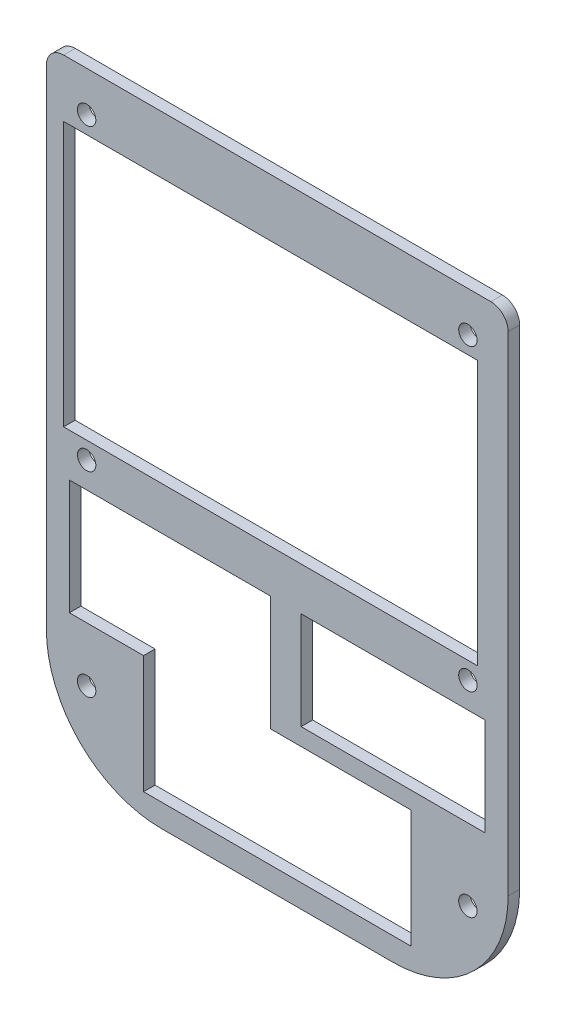
ISO-10303-21;
HEADER;
FILE_DESCRIPTION(('STEP AP214'),'2;1');
FILE_NAME('part.step','',(''),(''),'','','');
FILE_SCHEMA(('AUTOMOTIVE_DESIGN { 1 0 10303 214 1 1 1 1 }'));
ENDSEC;
DATA;
#1=APPLICATION_CONTEXT('core data for automotive mechanical design processes');
#2=APPLICATION_PROTOCOL_DEFINITION('international standard','automotive_design',2000,#1);
#3=PRODUCT_CONTEXT('',#1,'mechanical');
#4=PRODUCT('Part','Part','',(#3));
#5=PRODUCT_RELATED_PRODUCT_CATEGORY('part','',(#4));
#6=PRODUCT_DEFINITION_FORMATION('','',#4);
#7=PRODUCT_DEFINITION_CONTEXT('part definition',#1,'design');
#8=PRODUCT_DEFINITION('design','',#6,#7);
#9=PRODUCT_DEFINITION_SHAPE('','',#8);
#10=(LENGTH_UNIT() NAMED_UNIT(*) SI_UNIT(.MILLI.,.METRE.));
#11=(NAMED_UNIT(*) PLANE_ANGLE_UNIT() SI_UNIT($,.RADIAN.));
#12=(NAMED_UNIT(*) SI_UNIT($,.STERADIAN.) SOLID_ANGLE_UNIT());
#13=UNCERTAINTY_MEASURE_WITH_UNIT(LENGTH_MEASURE(1.E-05),#10,'distance_accuracy_value','');
#14=(GEOMETRIC_REPRESENTATION_CONTEXT(3) GLOBAL_UNCERTAINTY_ASSIGNED_CONTEXT((#13)) GLOBAL_UNIT_ASSIGNED_CONTEXT((#10,
#11,#12)) REPRESENTATION_CONTEXT('',''));
#15=CARTESIAN_POINT('',(0.,0.,0.));
#16=DIRECTION('',(0.,0.,1.));
#17=DIRECTION('',(1.,0.,0.));
#18=AXIS2_PLACEMENT_3D('',#15,#16,#17);
#19=CARTESIAN_POINT('',(0.,0.,2.));
#20=DIRECTION('',(0.,0.,-1.));
#21=DIRECTION('',(-1.,0.,0.));
#22=AXIS2_PLACEMENT_3D('',#19,#20,#21);
#23=PLANE('',#22);
#24=DIRECTION('',(0.,-1.,0.));
#25=VECTOR('',#24,1.);
#26=CARTESIAN_POINT('',(39.,0.,2.));
#27=LINE('',#26,#25);
#28=CARTESIAN_POINT('',(39.,2.50000000000001,2.));
#29=VERTEX_POINT('',#28);
#30=CARTESIAN_POINT('',(39.,-17.5,2.));
#31=VERTEX_POINT('',#30);
#32=EDGE_CURVE('E263',#29,#31,#27,.T.);
#33=ORIENTED_EDGE('',*,*,#32,.T.);
#34=DIRECTION('',(1.,0.,0.));
#35=VECTOR('',#34,1.);
#36=CARTESIAN_POINT('',(0.,-17.5,2.));
#37=LINE('',#36,#35);
#38=CARTESIAN_POINT('',(63.4,-17.5,2.));
#39=VERTEX_POINT('',#38);
#40=EDGE_CURVE('E270',#31,#39,#37,.T.);
#41=ORIENTED_EDGE('',*,*,#40,.T.);
#42=DIRECTION('',(0.,-1.,0.));
#43=VECTOR('',#42,1.);
#44=CARTESIAN_POINT('',(63.4,0.,2.));
#45=LINE('',#44,#43);
#46=CARTESIAN_POINT('',(63.4,-38.,2.));
#47=VERTEX_POINT('',#46);
#48=EDGE_CURVE('E306',#39,#47,#45,.T.);
#49=ORIENTED_EDGE('',*,*,#48,.T.);
#50=DIRECTION('',(1.,0.,0.));
#51=VECTOR('',#50,1.);
#52=CARTESIAN_POINT('',(0.,-38.,2.));
#53=LINE('',#52,#51);
#54=CARTESIAN_POINT('',(16.9,-38.,2.));
#55=VERTEX_POINT('',#54);
#56=EDGE_CURVE('E303',#55,#47,#53,.T.);
#57=ORIENTED_EDGE('',*,*,#56,.F.);
#58=DIRECTION('',(0.,-1.,0.));
#59=VECTOR('',#58,1.);
#60=CARTESIAN_POINT('',(16.9,0.,2.));
#61=LINE('',#60,#59);
#62=CARTESIAN_POINT('',(16.9,-17.5,2.));
#63=VERTEX_POINT('',#62);
#64=EDGE_CURVE('E300',#63,#55,#61,.T.);
#65=ORIENTED_EDGE('',*,*,#64,.F.);
#66=DIRECTION('',(1.,0.,0.));
#67=VECTOR('',#66,1.);
#68=CARTESIAN_POINT('',(0.,-17.5,2.));
#69=LINE('',#68,#67);
#70=CARTESIAN_POINT('',(4.,-17.5,2.));
#71=VERTEX_POINT('',#70);
#72=EDGE_CURVE('E297',#71,#63,#69,.T.);
#73=ORIENTED_EDGE('',*,*,#72,.F.);
#74=DIRECTION('',(0.,-1.,0.));
#75=VECTOR('',#74,1.);
#76=CARTESIAN_POINT('',(4.,0.,2.));
#77=LINE('',#76,#75);
#78=CARTESIAN_POINT('',(4.,2.5,2.));
#79=VERTEX_POINT('',#78);
#80=EDGE_CURVE('E294',#79,#71,#77,.T.);
#81=ORIENTED_EDGE('',*,*,#80,.F.);
#82=DIRECTION('',(1.,0.,0.));
#83=VECTOR('',#82,1.);
#84=CARTESIAN_POINT('',(0.,2.5,2.));
#85=LINE('',#84,#83);
#86=EDGE_CURVE('E291',#79,#29,#85,.T.);
#87=ORIENTED_EDGE('',*,*,#86,.T.);
#88=EDGE_LOOP('',(#33,#41,#49,#57,#65,#73,#81,#87));
#89=FACE_BOUND('',#88,.T.);
#90=DIRECTION('',(1.,0.,0.));
#91=VECTOR('',#90,1.);
#92=CARTESIAN_POINT('',(3.00000000000001,10.,2.));
#93=LINE('',#92,#91);
#94=CARTESIAN_POINT('',(3.00000000000001,10.,2.));
#95=VERTEX_POINT('',#94);
#96=CARTESIAN_POINT('',(75.,9.99999999999999,2.));
#97=VERTEX_POINT('',#96);
#98=EDGE_CURVE('E344',#95,#97,#93,.T.);
#99=ORIENTED_EDGE('',*,*,#98,.F.);
#100=DIRECTION('',(0.,-1.,0.));
#101=VECTOR('',#100,1.);
#102=CARTESIAN_POINT('',(3.00000000000001,56.,2.));
#103=LINE('',#102,#101);
#104=CARTESIAN_POINT('',(3.00000000000001,56.,2.));
#105=VERTEX_POINT('',#104);
#106=EDGE_CURVE('E314',#105,#95,#103,.T.);
#107=ORIENTED_EDGE('',*,*,#106,.F.);
#108=DIRECTION('',(-1.,0.,0.));
#109=VECTOR('',#108,1.);
#110=CARTESIAN_POINT('',(3.00000000000001,56.,2.));
#111=LINE('',#110,#109);
#112=CARTESIAN_POINT('',(75.,56.,2.));
#113=VERTEX_POINT('',#112);
#114=EDGE_CURVE('E333',#113,#105,#111,.T.);
#115=ORIENTED_EDGE('',*,*,#114,.F.);
#116=DIRECTION('',(0.,1.,0.));
#117=VECTOR('',#116,1.);
#118=CARTESIAN_POINT('',(75.,56.,2.));
#119=LINE('',#118,#117);
#120=EDGE_CURVE('E347',#97,#113,#119,.T.);
#121=ORIENTED_EDGE('',*,*,#120,.F.);
#122=EDGE_LOOP('',(#99,#107,#115,#121));
#123=FACE_BOUND('',#122,.T.);
#124=CARTESIAN_POINT('',(7.,-27.,2.));
#125=DIRECTION('',(0.,0.,1.));
#126=DIRECTION('',(1.,0.,0.));
#127=AXIS2_PLACEMENT_3D('',#124,#125,#126);
#128=CIRCLE('',#127,1.59999999999999);
#129=CARTESIAN_POINT('',(8.59999999999999,-27.,2.));
#130=VERTEX_POINT('',#129);
#131=EDGE_CURVE('E354',#130,#130,#128,.T.);
#132=ORIENTED_EDGE('',*,*,#131,.F.);
#133=EDGE_LOOP('',(#132));
#134=FACE_BOUND('',#133,.T.);
#135=CARTESIAN_POINT('',(73.3,-27.,2.));
#136=DIRECTION('',(0.,0.,1.));
#137=DIRECTION('',(1.,0.,0.));
#138=AXIS2_PLACEMENT_3D('',#135,#136,#137);
#139=CIRCLE('',#138,1.59999999999999);
#140=CARTESIAN_POINT('',(74.9,-27.,2.));
#141=VERTEX_POINT('',#140);
#142=EDGE_CURVE('E363',#141,#141,#139,.T.);
#143=ORIENTED_EDGE('',*,*,#142,.F.);
#144=EDGE_LOOP('',(#143));
#145=FACE_BOUND('',#144,.T.);
#146=CARTESIAN_POINT('',(7.,59.,2.));
#147=DIRECTION('',(0.,0.,1.));
#148=DIRECTION('',(1.,0.,0.));
#149=AXIS2_PLACEMENT_3D('',#146,#147,#148);
#150=CIRCLE('',#149,1.59999999999999);
#151=CARTESIAN_POINT('',(8.59999999999999,59.,2.));
#152=VERTEX_POINT('',#151);
#153=EDGE_CURVE('E373',#152,#152,#150,.T.);
#154=ORIENTED_EDGE('',*,*,#153,.F.);
#155=EDGE_LOOP('',(#154));
#156=FACE_BOUND('',#155,.T.);
#157=CARTESIAN_POINT('',(73.3,59.,2.));
#158=DIRECTION('',(0.,0.,1.));
#159=DIRECTION('',(1.,0.,0.));
#160=AXIS2_PLACEMENT_3D('',#157,#158,#159);
#161=CIRCLE('',#160,1.59999999999999);
#162=CARTESIAN_POINT('',(74.9,59.,2.));
#163=VERTEX_POINT('',#162);
#164=EDGE_CURVE('E379',#163,#163,#161,.T.);
#165=ORIENTED_EDGE('',*,*,#164,.F.);
#166=EDGE_LOOP('',(#165));
#167=FACE_BOUND('',#166,.T.);
#168=CARTESIAN_POINT('',(73.3,7.,2.));
#169=DIRECTION('',(0.,0.,1.));
#170=DIRECTION('',(1.,0.,0.));
#171=AXIS2_PLACEMENT_3D('',#168,#169,#170);
#172=CIRCLE('',#171,1.59999999999999);
#173=CARTESIAN_POINT('',(74.9,7.,2.));
#174=VERTEX_POINT('',#173);
#175=EDGE_CURVE('E385',#174,#174,#172,.T.);
#176=ORIENTED_EDGE('',*,*,#175,.F.);
#177=EDGE_LOOP('',(#176));
#178=FACE_BOUND('',#177,.T.);
#179=CARTESIAN_POINT('',(7.00000000000001,7.,2.));
#180=DIRECTION('',(0.,0.,1.));
#181=DIRECTION('',(1.,0.,0.));
#182=AXIS2_PLACEMENT_3D('',#179,#180,#181);
#183=CIRCLE('',#182,1.59999999999999);
#184=CARTESIAN_POINT('',(8.59999999999999,7.,2.));
#185=VERTEX_POINT('',#184);
#186=EDGE_CURVE('E391',#185,#185,#183,.T.);
#187=ORIENTED_EDGE('',*,*,#186,.F.);
#188=EDGE_LOOP('',(#187));
#189=FACE_BOUND('',#188,.T.);
#190=DIRECTION('',(0.,-1.,0.));
#191=VECTOR('',#190,1.);
#192=CARTESIAN_POINT('',(0.,0.,2.));
#193=LINE('',#192,#191);
#194=CARTESIAN_POINT('',(0.,63.,2.));
#195=VERTEX_POINT('',#194);
#196=CARTESIAN_POINT('',(0.,-22.,2.));
#197=VERTEX_POINT('',#196);
#198=EDGE_CURVE('E398',#195,#197,#193,.T.);
#199=ORIENTED_EDGE('',*,*,#198,.T.);
#200=CARTESIAN_POINT('',(20.,-22.,2.));
#201=DIRECTION('',(0.,0.,-1.));
#202=DIRECTION('',(-1.,0.,0.));
#203=AXIS2_PLACEMENT_3D('',#200,#201,#202);
#204=CIRCLE('',#203,20.);
#205=CARTESIAN_POINT('',(20.,-42.,2.));
#206=VERTEX_POINT('',#205);
#207=EDGE_CURVE('E78',#197,#206,#204,.F.);
#208=ORIENTED_EDGE('',*,*,#207,.T.);
#209=DIRECTION('',(-1.,0.,0.));
#210=VECTOR('',#209,1.);
#211=CARTESIAN_POINT('',(80.3,-42.,2.));
#212=LINE('',#211,#210);
#213=CARTESIAN_POINT('',(60.3,-42.,2.));
#214=VERTEX_POINT('',#213);
#215=EDGE_CURVE('E370',#214,#206,#212,.T.);
#216=ORIENTED_EDGE('',*,*,#215,.F.);
#217=CARTESIAN_POINT('',(60.3,-22.,2.));
#218=DIRECTION('',(0.,0.,-1.));
#219=DIRECTION('',(-1.,0.,0.));
#220=AXIS2_PLACEMENT_3D('',#217,#218,#219);
#221=CIRCLE('',#220,20.);
#222=CARTESIAN_POINT('',(80.3,-22.,2.));
#223=VERTEX_POINT('',#222);
#224=EDGE_CURVE('E445',#214,#223,#221,.F.);
#225=ORIENTED_EDGE('',*,*,#224,.T.);
#226=DIRECTION('',(0.,1.,0.));
#227=VECTOR('',#226,1.);
#228=CARTESIAN_POINT('',(80.3,0.,2.));
#229=LINE('',#228,#227);
#230=CARTESIAN_POINT('',(80.3,63.,2.));
#231=VERTEX_POINT('',#230);
#232=EDGE_CURVE('E401',#223,#231,#229,.T.);
#233=ORIENTED_EDGE('',*,*,#232,.T.);
#234=CARTESIAN_POINT('',(77.3,63.,2.));
#235=DIRECTION('',(0.,0.,-1.));
#236=DIRECTION('',(-1.,0.,0.));
#237=AXIS2_PLACEMENT_3D('',#234,#235,#236);
#238=CIRCLE('',#237,3.);
#239=CARTESIAN_POINT('',(77.3,66.,2.));
#240=VERTEX_POINT('',#239);
#241=EDGE_CURVE('E428',#231,#240,#238,.F.);
#242=ORIENTED_EDGE('',*,*,#241,.T.);
#243=DIRECTION('',(-1.,0.,0.));
#244=VECTOR('',#243,1.);
#245=CARTESIAN_POINT('',(0.,66.,2.));
#246=LINE('',#245,#244);
#247=CARTESIAN_POINT('',(3.,66.,2.));
#248=VERTEX_POINT('',#247);
#249=EDGE_CURVE('E404',#240,#248,#246,.T.);
#250=ORIENTED_EDGE('',*,*,#249,.T.);
#251=CARTESIAN_POINT('',(3.,63.,2.));
#252=DIRECTION('',(0.,0.,-1.));
#253=DIRECTION('',(-1.,0.,0.));
#254=AXIS2_PLACEMENT_3D('',#251,#252,#253);
#255=CIRCLE('',#254,3.);
#256=EDGE_CURVE('E426',#248,#195,#255,.F.);
#257=ORIENTED_EDGE('',*,*,#256,.T.);
#258=EDGE_LOOP('',(#199,#208,#216,#225,#233,#242,#250,#257));
#259=FACE_BOUND('',#258,.T.);
#260=DIRECTION('',(0.,-1.,0.));
#261=VECTOR('',#260,1.);
#262=CARTESIAN_POINT('',(76.3,0.,2.));
#263=LINE('',#262,#261);
#264=CARTESIAN_POINT('',(76.3,2.5,2.));
#265=VERTEX_POINT('',#264);
#266=CARTESIAN_POINT('',(76.3,-14.5,2.));
#267=VERTEX_POINT('',#266);
#268=EDGE_CURVE('E86',#265,#267,#263,.T.);
#269=ORIENTED_EDGE('',*,*,#268,.T.);
#270=DIRECTION('',(1.,0.,0.));
#271=VECTOR('',#270,1.);
#272=CARTESIAN_POINT('',(0.,-14.5,2.));
#273=LINE('',#272,#271);
#274=CARTESIAN_POINT('',(44.3,-14.5,2.));
#275=VERTEX_POINT('',#274);
#276=EDGE_CURVE('E248',#275,#267,#273,.T.);
#277=ORIENTED_EDGE('',*,*,#276,.F.);
#278=DIRECTION('',(0.,-1.,0.));
#279=VECTOR('',#278,1.);
#280=CARTESIAN_POINT('',(44.3,0.,2.));
#281=LINE('',#280,#279);
#282=CARTESIAN_POINT('',(44.3,2.5,2.));
#283=VERTEX_POINT('',#282);
#284=EDGE_CURVE('E251',#283,#275,#281,.T.);
#285=ORIENTED_EDGE('',*,*,#284,.F.);
#286=DIRECTION('',(1.,0.,0.));
#287=VECTOR('',#286,1.);
#288=CARTESIAN_POINT('',(0.,2.50000000000001,2.));
#289=LINE('',#288,#287);
#290=EDGE_CURVE('E257',#283,#265,#289,.T.);
#291=ORIENTED_EDGE('',*,*,#290,.T.);
#292=EDGE_LOOP('',(#269,#277,#285,#291));
#293=FACE_BOUND('',#292,.T.);
#294=ADVANCED_FACE('F69',(#89,#123,#134,#145,#156,#167,#178,#189,#259,#293),#23,.F.);
#295=CARTESIAN_POINT('',(0.,0.,0.));
#296=DIRECTION('',(0.,0.,-1.));
#297=DIRECTION('',(-1.,0.,0.));
#298=AXIS2_PLACEMENT_3D('',#295,#296,#297);
#299=PLANE('',#298);
#300=DIRECTION('',(1.,0.,0.));
#301=VECTOR('',#300,1.);
#302=CARTESIAN_POINT('',(0.,-17.5,0.));
#303=LINE('',#302,#301);
#304=CARTESIAN_POINT('',(39.,-17.5,0.));
#305=VERTEX_POINT('',#304);
#306=CARTESIAN_POINT('',(63.4,-17.5,0.));
#307=VERTEX_POINT('',#306);
#308=EDGE_CURVE('E286',#305,#307,#303,.T.);
#309=ORIENTED_EDGE('',*,*,#308,.F.);
#310=DIRECTION('',(0.,-1.,0.));
#311=VECTOR('',#310,1.);
#312=CARTESIAN_POINT('',(39.,0.,0.));
#313=LINE('',#312,#311);
#314=CARTESIAN_POINT('',(39.,2.50000000000001,0.));
#315=VERTEX_POINT('',#314);
#316=EDGE_CURVE('E267',#315,#305,#313,.T.);
#317=ORIENTED_EDGE('',*,*,#316,.F.);
#318=DIRECTION('',(1.,0.,0.));
#319=VECTOR('',#318,1.);
#320=CARTESIAN_POINT('',(0.,2.5,0.));
#321=LINE('',#320,#319);
#322=CARTESIAN_POINT('',(4.,2.5,0.));
#323=VERTEX_POINT('',#322);
#324=EDGE_CURVE('E269',#323,#315,#321,.T.);
#325=ORIENTED_EDGE('',*,*,#324,.F.);
#326=DIRECTION('',(0.,-1.,0.));
#327=VECTOR('',#326,1.);
#328=CARTESIAN_POINT('',(4.,0.,0.));
#329=LINE('',#328,#327);
#330=CARTESIAN_POINT('',(4.,-17.5,0.));
#331=VERTEX_POINT('',#330);
#332=EDGE_CURVE('E272',#323,#331,#329,.T.);
#333=ORIENTED_EDGE('',*,*,#332,.T.);
#334=DIRECTION('',(1.,0.,0.));
#335=VECTOR('',#334,1.);
#336=CARTESIAN_POINT('',(0.,-17.5,0.));
#337=LINE('',#336,#335);
#338=CARTESIAN_POINT('',(16.9,-17.5,0.));
#339=VERTEX_POINT('',#338);
#340=EDGE_CURVE('E275',#331,#339,#337,.T.);
#341=ORIENTED_EDGE('',*,*,#340,.T.);
#342=DIRECTION('',(0.,-1.,0.));
#343=VECTOR('',#342,1.);
#344=CARTESIAN_POINT('',(16.9,0.,0.));
#345=LINE('',#344,#343);
#346=CARTESIAN_POINT('',(16.9,-38.,0.));
#347=VERTEX_POINT('',#346);
#348=EDGE_CURVE('E278',#339,#347,#345,.T.);
#349=ORIENTED_EDGE('',*,*,#348,.T.);
#350=DIRECTION('',(1.,0.,0.));
#351=VECTOR('',#350,1.);
#352=CARTESIAN_POINT('',(0.,-38.,0.));
#353=LINE('',#352,#351);
#354=CARTESIAN_POINT('',(63.4,-38.,0.));
#355=VERTEX_POINT('',#354);
#356=EDGE_CURVE('E281',#347,#355,#353,.T.);
#357=ORIENTED_EDGE('',*,*,#356,.T.);
#358=DIRECTION('',(0.,-1.,0.));
#359=VECTOR('',#358,1.);
#360=CARTESIAN_POINT('',(63.4,0.,0.));
#361=LINE('',#360,#359);
#362=EDGE_CURVE('E284',#307,#355,#361,.T.);
#363=ORIENTED_EDGE('',*,*,#362,.F.);
#364=EDGE_LOOP('',(#309,#317,#325,#333,#341,#349,#357,#363));
#365=FACE_BOUND('',#364,.T.);
#366=DIRECTION('',(0.,-1.,0.));
#367=VECTOR('',#366,1.);
#368=CARTESIAN_POINT('',(3.00000000000001,56.,0.));
#369=LINE('',#368,#367);
#370=CARTESIAN_POINT('',(3.00000000000001,56.,0.));
#371=VERTEX_POINT('',#370);
#372=CARTESIAN_POINT('',(3.00000000000001,10.,0.));
#373=VERTEX_POINT('',#372);
#374=EDGE_CURVE('E329',#371,#373,#369,.T.);
#375=ORIENTED_EDGE('',*,*,#374,.T.);
#376=DIRECTION('',(1.,0.,0.));
#377=VECTOR('',#376,1.);
#378=CARTESIAN_POINT('',(3.00000000000001,10.,0.));
#379=LINE('',#378,#377);
#380=CARTESIAN_POINT('',(75.,9.99999999999999,0.));
#381=VERTEX_POINT('',#380);
#382=EDGE_CURVE('E332',#373,#381,#379,.T.);
#383=ORIENTED_EDGE('',*,*,#382,.T.);
#384=DIRECTION('',(0.,1.,0.));
#385=VECTOR('',#384,1.);
#386=CARTESIAN_POINT('',(75.,56.,0.));
#387=LINE('',#386,#385);
#388=CARTESIAN_POINT('',(75.,56.,0.));
#389=VERTEX_POINT('',#388);
#390=EDGE_CURVE('E336',#381,#389,#387,.T.);
#391=ORIENTED_EDGE('',*,*,#390,.T.);
#392=DIRECTION('',(-1.,0.,0.));
#393=VECTOR('',#392,1.);
#394=CARTESIAN_POINT('',(3.00000000000001,56.,0.));
#395=LINE('',#394,#393);
#396=EDGE_CURVE('E339',#389,#371,#395,.T.);
#397=ORIENTED_EDGE('',*,*,#396,.T.);
#398=EDGE_LOOP('',(#375,#383,#391,#397));
#399=FACE_BOUND('',#398,.T.);
#400=CARTESIAN_POINT('',(7.,-27.,0.));
#401=DIRECTION('',(0.,0.,-1.));
#402=DIRECTION('',(-1.,0.,0.));
#403=AXIS2_PLACEMENT_3D('',#400,#401,#402);
#404=CIRCLE('',#403,1.59999999999999);
#405=CARTESIAN_POINT('',(5.40000000000002,-27.,0.));
#406=VERTEX_POINT('',#405);
#407=EDGE_CURVE('E73',#406,#406,#404,.T.);
#408=ORIENTED_EDGE('',*,*,#407,.F.);
#409=EDGE_LOOP('',(#408));
#410=FACE_BOUND('',#409,.T.);
#411=CARTESIAN_POINT('',(73.3,-27.,0.));
#412=DIRECTION('',(0.,0.,-1.));
#413=DIRECTION('',(-1.,0.,0.));
#414=AXIS2_PLACEMENT_3D('',#411,#412,#413);
#415=CIRCLE('',#414,1.59999999999998);
#416=CARTESIAN_POINT('',(71.7,-27.,0.));
#417=VERTEX_POINT('',#416);
#418=EDGE_CURVE('E366',#417,#417,#415,.T.);
#419=ORIENTED_EDGE('',*,*,#418,.F.);
#420=EDGE_LOOP('',(#419));
#421=FACE_BOUND('',#420,.T.);
#422=CARTESIAN_POINT('',(7.,59.,0.));
#423=DIRECTION('',(0.,0.,1.));
#424=DIRECTION('',(1.,0.,0.));
#425=AXIS2_PLACEMENT_3D('',#422,#423,#424);
#426=CIRCLE('',#425,1.6);
#427=CARTESIAN_POINT('',(8.6,59.,0.));
#428=VERTEX_POINT('',#427);
#429=EDGE_CURVE('E376',#428,#428,#426,.T.);
#430=ORIENTED_EDGE('',*,*,#429,.T.);
#431=EDGE_LOOP('',(#430));
#432=FACE_BOUND('',#431,.T.);
#433=CARTESIAN_POINT('',(73.3,59.,0.));
#434=DIRECTION('',(0.,0.,1.));
#435=DIRECTION('',(1.,0.,0.));
#436=AXIS2_PLACEMENT_3D('',#433,#434,#435);
#437=CIRCLE('',#436,1.6);
#438=CARTESIAN_POINT('',(74.9,59.,0.));
#439=VERTEX_POINT('',#438);
#440=EDGE_CURVE('E382',#439,#439,#437,.T.);
#441=ORIENTED_EDGE('',*,*,#440,.T.);
#442=EDGE_LOOP('',(#441));
#443=FACE_BOUND('',#442,.T.);
#444=CARTESIAN_POINT('',(73.3,7.,0.));
#445=DIRECTION('',(0.,0.,1.));
#446=DIRECTION('',(1.,0.,0.));
#447=AXIS2_PLACEMENT_3D('',#444,#445,#446);
#448=CIRCLE('',#447,1.6);
#449=CARTESIAN_POINT('',(74.9,7.,0.));
#450=VERTEX_POINT('',#449);
#451=EDGE_CURVE('E388',#450,#450,#448,.T.);
#452=ORIENTED_EDGE('',*,*,#451,.T.);
#453=EDGE_LOOP('',(#452));
#454=FACE_BOUND('',#453,.T.);
#455=CARTESIAN_POINT('',(7.00000000000001,7.,0.));
#456=DIRECTION('',(0.,0.,1.));
#457=DIRECTION('',(1.,0.,0.));
#458=AXIS2_PLACEMENT_3D('',#455,#456,#457);
#459=CIRCLE('',#458,1.6);
#460=CARTESIAN_POINT('',(8.6,7.,0.));
#461=VERTEX_POINT('',#460);
#462=EDGE_CURVE('E394',#461,#461,#459,.T.);
#463=ORIENTED_EDGE('',*,*,#462,.T.);
#464=EDGE_LOOP('',(#463));
#465=FACE_BOUND('',#464,.T.);
#466=DIRECTION('',(1.,0.,0.));
#467=VECTOR('',#466,1.);
#468=CARTESIAN_POINT('',(0.,-42.,0.));
#469=LINE('',#468,#467);
#470=CARTESIAN_POINT('',(20.,-42.,0.));
#471=VERTEX_POINT('',#470);
#472=CARTESIAN_POINT('',(60.3,-42.,0.));
#473=VERTEX_POINT('',#472);
#474=EDGE_CURVE('E367',#471,#473,#469,.T.);
#475=ORIENTED_EDGE('',*,*,#474,.F.);
#476=CARTESIAN_POINT('',(20.,-22.,0.));
#477=DIRECTION('',(0.,0.,-1.));
#478=DIRECTION('',(-1.,0.,0.));
#479=AXIS2_PLACEMENT_3D('',#476,#477,#478);
#480=CIRCLE('',#479,20.);
#481=CARTESIAN_POINT('',(0.,-22.,0.));
#482=VERTEX_POINT('',#481);
#483=EDGE_CURVE('E441',#471,#482,#480,.T.);
#484=ORIENTED_EDGE('',*,*,#483,.T.);
#485=DIRECTION('',(0.,-1.,0.));
#486=VECTOR('',#485,1.);
#487=CARTESIAN_POINT('',(0.,0.,0.));
#488=LINE('',#487,#486);
#489=CARTESIAN_POINT('',(0.,63.,0.));
#490=VERTEX_POINT('',#489);
#491=EDGE_CURVE('E397',#490,#482,#488,.T.);
#492=ORIENTED_EDGE('',*,*,#491,.F.);
#493=CARTESIAN_POINT('',(3.,63.,0.));
#494=DIRECTION('',(0.,0.,-1.));
#495=DIRECTION('',(-1.,0.,0.));
#496=AXIS2_PLACEMENT_3D('',#493,#494,#495);
#497=CIRCLE('',#496,3.);
#498=CARTESIAN_POINT('',(3.,66.,0.));
#499=VERTEX_POINT('',#498);
#500=EDGE_CURVE('E418',#490,#499,#497,.T.);
#501=ORIENTED_EDGE('',*,*,#500,.T.);
#502=DIRECTION('',(-1.,0.,0.));
#503=VECTOR('',#502,1.);
#504=CARTESIAN_POINT('',(0.,66.,0.));
#505=LINE('',#504,#503);
#506=CARTESIAN_POINT('',(77.3,66.,0.));
#507=VERTEX_POINT('',#506);
#508=EDGE_CURVE('E402',#507,#499,#505,.T.);
#509=ORIENTED_EDGE('',*,*,#508,.F.);
#510=CARTESIAN_POINT('',(77.3,63.,0.));
#511=DIRECTION('',(0.,0.,-1.));
#512=DIRECTION('',(-1.,0.,0.));
#513=AXIS2_PLACEMENT_3D('',#510,#511,#512);
#514=CIRCLE('',#513,3.);
#515=CARTESIAN_POINT('',(80.3,63.,0.));
#516=VERTEX_POINT('',#515);
#517=EDGE_CURVE('E420',#507,#516,#514,.T.);
#518=ORIENTED_EDGE('',*,*,#517,.T.);
#519=DIRECTION('',(0.,1.,0.));
#520=VECTOR('',#519,1.);
#521=CARTESIAN_POINT('',(80.3,0.,0.));
#522=LINE('',#521,#520);
#523=CARTESIAN_POINT('',(80.3,-22.,0.));
#524=VERTEX_POINT('',#523);
#525=EDGE_CURVE('E410',#524,#516,#522,.T.);
#526=ORIENTED_EDGE('',*,*,#525,.F.);
#527=CARTESIAN_POINT('',(60.3,-22.,0.));
#528=DIRECTION('',(0.,0.,-1.));
#529=DIRECTION('',(-1.,0.,0.));
#530=AXIS2_PLACEMENT_3D('',#527,#528,#529);
#531=CIRCLE('',#530,20.);
#532=EDGE_CURVE('E439',#524,#473,#531,.T.);
#533=ORIENTED_EDGE('',*,*,#532,.T.);
#534=EDGE_LOOP('',(#475,#484,#492,#501,#509,#518,#526,#533));
#535=FACE_BOUND('',#534,.T.);
#536=DIRECTION('',(1.,0.,0.));
#537=VECTOR('',#536,1.);
#538=CARTESIAN_POINT('',(0.,-14.5,0.));
#539=LINE('',#538,#537);
#540=CARTESIAN_POINT('',(44.3,-14.5,0.));
#541=VERTEX_POINT('',#540);
#542=CARTESIAN_POINT('',(76.3,-14.5,0.));
#543=VERTEX_POINT('',#542);
#544=EDGE_CURVE('E243',#541,#543,#539,.T.);
#545=ORIENTED_EDGE('',*,*,#544,.T.);
#546=DIRECTION('',(0.,-1.,0.));
#547=VECTOR('',#546,1.);
#548=CARTESIAN_POINT('',(76.3,0.,0.));
#549=LINE('',#548,#547);
#550=CARTESIAN_POINT('',(76.3,2.5,0.));
#551=VERTEX_POINT('',#550);
#552=EDGE_CURVE('E239',#551,#543,#549,.T.);
#553=ORIENTED_EDGE('',*,*,#552,.F.);
#554=DIRECTION('',(1.,0.,0.));
#555=VECTOR('',#554,1.);
#556=CARTESIAN_POINT('',(0.,2.50000000000001,0.));
#557=LINE('',#556,#555);
#558=CARTESIAN_POINT('',(44.3,2.5,0.));
#559=VERTEX_POINT('',#558);
#560=EDGE_CURVE('E231',#559,#551,#557,.T.);
#561=ORIENTED_EDGE('',*,*,#560,.F.);
#562=DIRECTION('',(0.,-1.,0.));
#563=VECTOR('',#562,1.);
#564=CARTESIAN_POINT('',(44.3,0.,0.));
#565=LINE('',#564,#563);
#566=EDGE_CURVE('E94',#559,#541,#565,.T.);
#567=ORIENTED_EDGE('',*,*,#566,.T.);
#568=EDGE_LOOP('',(#545,#553,#561,#567));
#569=FACE_BOUND('',#568,.T.);
#570=ADVANCED_FACE('F246',(#365,#399,#410,#421,#432,#443,#454,#465,#535,#569),#299,.T.);
#571=CARTESIAN_POINT('',(0.,0.,2.));
#572=DIRECTION('',(1.,0.,0.));
#573=DIRECTION('',(0.,0.,-1.));
#574=AXIS2_PLACEMENT_3D('',#571,#572,#573);
#575=PLANE('',#574);
#576=ORIENTED_EDGE('',*,*,#491,.T.);
#577=DIRECTION('',(0.,0.,-1.));
#578=VECTOR('',#577,1.);
#579=CARTESIAN_POINT('',(0.,-22.,2.));
#580=LINE('',#579,#578);
#581=EDGE_CURVE('E443',#482,#197,#580,.F.);
#582=ORIENTED_EDGE('',*,*,#581,.T.);
#583=ORIENTED_EDGE('',*,*,#198,.F.);
#584=DIRECTION('',(0.,0.,-1.));
#585=VECTOR('',#584,1.);
#586=CARTESIAN_POINT('',(0.,63.,2.));
#587=LINE('',#586,#585);
#588=EDGE_CURVE('E430',#195,#490,#587,.T.);
#589=ORIENTED_EDGE('',*,*,#588,.T.);
#590=EDGE_LOOP('',(#576,#582,#583,#589));
#591=FACE_BOUND('',#590,.T.);
#592=ADVANCED_FACE('F455',(#591),#575,.F.);
#593=CARTESIAN_POINT('',(80.3,0.,2.));
#594=DIRECTION('',(-1.,0.,0.));
#595=DIRECTION('',(0.,0.,1.));
#596=AXIS2_PLACEMENT_3D('',#593,#594,#595);
#597=PLANE('',#596);
#598=ORIENTED_EDGE('',*,*,#232,.F.);
#599=DIRECTION('',(0.,0.,1.));
#600=VECTOR('',#599,1.);
#601=CARTESIAN_POINT('',(80.3,-22.,0.));
#602=LINE('',#601,#600);
#603=EDGE_CURVE('E12',#223,#524,#602,.F.);
#604=ORIENTED_EDGE('',*,*,#603,.T.);
#605=ORIENTED_EDGE('',*,*,#525,.T.);
#606=DIRECTION('',(0.,0.,-1.));
#607=VECTOR('',#606,1.);
#608=CARTESIAN_POINT('',(80.3,63.,2.));
#609=LINE('',#608,#607);
#610=EDGE_CURVE('E423',#516,#231,#609,.F.);
#611=ORIENTED_EDGE('',*,*,#610,.T.);
#612=EDGE_LOOP('',(#598,#604,#605,#611));
#613=FACE_BOUND('',#612,.T.);
#614=ADVANCED_FACE('F481',(#613),#597,.F.);
#615=CARTESIAN_POINT('',(0.,66.,2.));
#616=DIRECTION('',(0.,-1.,0.));
#617=DIRECTION('',(0.,0.,-1.));
#618=AXIS2_PLACEMENT_3D('',#615,#616,#617);
#619=PLANE('',#618);
#620=ORIENTED_EDGE('',*,*,#249,.F.);
#621=DIRECTION('',(0.,0.,-1.));
#622=VECTOR('',#621,1.);
#623=CARTESIAN_POINT('',(77.3,66.,2.));
#624=LINE('',#623,#622);
#625=EDGE_CURVE('E415',#240,#507,#624,.T.);
#626=ORIENTED_EDGE('',*,*,#625,.T.);
#627=ORIENTED_EDGE('',*,*,#508,.T.);
#628=DIRECTION('',(0.,0.,-1.));
#629=VECTOR('',#628,1.);
#630=CARTESIAN_POINT('',(3.,66.,2.));
#631=LINE('',#630,#629);
#632=EDGE_CURVE('E407',#499,#248,#631,.F.);
#633=ORIENTED_EDGE('',*,*,#632,.T.);
#634=EDGE_LOOP('',(#620,#626,#627,#633));
#635=FACE_BOUND('',#634,.T.);
#636=ADVANCED_FACE('F490',(#635),#619,.F.);
#637=CARTESIAN_POINT('',(7.00000000000001,7.,2.));
#638=DIRECTION('',(0.,0.,1.));
#639=DIRECTION('',(1.,0.,0.));
#640=AXIS2_PLACEMENT_3D('',#637,#638,#639);
#641=CYLINDRICAL_SURFACE('',#640,1.59999999999999);
#642=ORIENTED_EDGE('',*,*,#462,.F.);
#643=EDGE_LOOP('',(#642));
#644=FACE_BOUND('',#643,.T.);
#645=ORIENTED_EDGE('',*,*,#186,.T.);
#646=EDGE_LOOP('',(#645));
#647=FACE_BOUND('',#646,.T.);
#648=ADVANCED_FACE('F516',(#644,#647),#641,.F.);
#649=CARTESIAN_POINT('',(73.3,7.,2.));
#650=DIRECTION('',(0.,0.,1.));
#651=DIRECTION('',(1.,0.,0.));
#652=AXIS2_PLACEMENT_3D('',#649,#650,#651);
#653=CYLINDRICAL_SURFACE('',#652,1.6);
#654=ORIENTED_EDGE('',*,*,#451,.F.);
#655=EDGE_LOOP('',(#654));
#656=FACE_BOUND('',#655,.T.);
#657=ORIENTED_EDGE('',*,*,#175,.T.);
#658=EDGE_LOOP('',(#657));
#659=FACE_BOUND('',#658,.T.);
#660=ADVANCED_FACE('F747',(#656,#659),#653,.F.);
#661=CARTESIAN_POINT('',(73.3,59.,2.));
#662=DIRECTION('',(0.,0.,1.));
#663=DIRECTION('',(1.,0.,0.));
#664=AXIS2_PLACEMENT_3D('',#661,#662,#663);
#665=CYLINDRICAL_SURFACE('',#664,1.6);
#666=ORIENTED_EDGE('',*,*,#440,.F.);
#667=EDGE_LOOP('',(#666));
#668=FACE_BOUND('',#667,.T.);
#669=ORIENTED_EDGE('',*,*,#164,.T.);
#670=EDGE_LOOP('',(#669));
#671=FACE_BOUND('',#670,.T.);
#672=ADVANCED_FACE('F744',(#668,#671),#665,.F.);
#673=CARTESIAN_POINT('',(7.,59.,2.));
#674=DIRECTION('',(0.,0.,1.));
#675=DIRECTION('',(1.,0.,0.));
#676=AXIS2_PLACEMENT_3D('',#673,#674,#675);
#677=CYLINDRICAL_SURFACE('',#676,1.59999999999999);
#678=ORIENTED_EDGE('',*,*,#429,.F.);
#679=EDGE_LOOP('',(#678));
#680=FACE_BOUND('',#679,.T.);
#681=ORIENTED_EDGE('',*,*,#153,.T.);
#682=EDGE_LOOP('',(#681));
#683=FACE_BOUND('',#682,.T.);
#684=ADVANCED_FACE('F526',(#680,#683),#677,.F.);
#685=CARTESIAN_POINT('',(77.3,63.,2.));
#686=DIRECTION('',(0.,0.,-1.));
#687=DIRECTION('',(-1.,0.,0.));
#688=AXIS2_PLACEMENT_3D('',#685,#686,#687);
#689=CYLINDRICAL_SURFACE('',#688,3.);
#690=ORIENTED_EDGE('',*,*,#241,.F.);
#691=ORIENTED_EDGE('',*,*,#610,.F.);
#692=ORIENTED_EDGE('',*,*,#517,.F.);
#693=ORIENTED_EDGE('',*,*,#625,.F.);
#694=EDGE_LOOP('',(#690,#691,#692,#693));
#695=FACE_BOUND('',#694,.T.);
#696=ADVANCED_FACE('F486',(#695),#689,.T.);
#697=CARTESIAN_POINT('',(3.,63.,2.));
#698=DIRECTION('',(0.,0.,-1.));
#699=DIRECTION('',(-1.,0.,0.));
#700=AXIS2_PLACEMENT_3D('',#697,#698,#699);
#701=CYLINDRICAL_SURFACE('',#700,3.);
#702=ORIENTED_EDGE('',*,*,#256,.F.);
#703=ORIENTED_EDGE('',*,*,#632,.F.);
#704=ORIENTED_EDGE('',*,*,#500,.F.);
#705=ORIENTED_EDGE('',*,*,#588,.F.);
#706=EDGE_LOOP('',(#702,#703,#704,#705));
#707=FACE_BOUND('',#706,.T.);
#708=ADVANCED_FACE('F494',(#707),#701,.T.);
#709=CARTESIAN_POINT('',(0.,-42.,0.));
#710=DIRECTION('',(0.,-1.,0.));
#711=DIRECTION('',(0.,0.,-1.));
#712=AXIS2_PLACEMENT_3D('',#709,#710,#711);
#713=PLANE('',#712);
#714=ORIENTED_EDGE('',*,*,#215,.T.);
#715=DIRECTION('',(0.,0.,-1.));
#716=VECTOR('',#715,1.);
#717=CARTESIAN_POINT('',(20.,-42.,0.));
#718=LINE('',#717,#716);
#719=EDGE_CURVE('E436',#206,#471,#718,.T.);
#720=ORIENTED_EDGE('',*,*,#719,.T.);
#721=ORIENTED_EDGE('',*,*,#474,.T.);
#722=DIRECTION('',(0.,0.,1.));
#723=VECTOR('',#722,1.);
#724=CARTESIAN_POINT('',(60.3,-42.,2.));
#725=LINE('',#724,#723);
#726=EDGE_CURVE('E433',#473,#214,#725,.T.);
#727=ORIENTED_EDGE('',*,*,#726,.T.);
#728=EDGE_LOOP('',(#714,#720,#721,#727));
#729=FACE_BOUND('',#728,.T.);
#730=ADVANCED_FACE('F472',(#729),#713,.T.);
#731=CARTESIAN_POINT('',(20.,-22.,0.));
#732=DIRECTION('',(0.,0.,1.));
#733=DIRECTION('',(1.,0.,0.));
#734=AXIS2_PLACEMENT_3D('',#731,#732,#733);
#735=CYLINDRICAL_SURFACE('',#734,20.);
#736=ORIENTED_EDGE('',*,*,#207,.F.);
#737=ORIENTED_EDGE('',*,*,#581,.F.);
#738=ORIENTED_EDGE('',*,*,#483,.F.);
#739=ORIENTED_EDGE('',*,*,#719,.F.);
#740=EDGE_LOOP('',(#736,#737,#738,#739));
#741=FACE_BOUND('',#740,.T.);
#742=ADVANCED_FACE('F501',(#741),#735,.T.);
#743=CARTESIAN_POINT('',(60.3,-22.,0.));
#744=DIRECTION('',(0.,0.,-1.));
#745=DIRECTION('',(-1.,0.,0.));
#746=AXIS2_PLACEMENT_3D('',#743,#744,#745);
#747=CYLINDRICAL_SURFACE('',#746,20.);
#748=ORIENTED_EDGE('',*,*,#532,.F.);
#749=ORIENTED_EDGE('',*,*,#603,.F.);
#750=ORIENTED_EDGE('',*,*,#224,.F.);
#751=ORIENTED_EDGE('',*,*,#726,.F.);
#752=EDGE_LOOP('',(#748,#749,#750,#751));
#753=FACE_BOUND('',#752,.T.);
#754=ADVANCED_FACE('F71',(#753),#747,.T.);
#755=CARTESIAN_POINT('',(73.3,-27.,2.));
#756=DIRECTION('',(0.,0.,1.));
#757=DIRECTION('',(1.,0.,0.));
#758=AXIS2_PLACEMENT_3D('',#755,#756,#757);
#759=CYLINDRICAL_SURFACE('',#758,1.59999999999998);
#760=ORIENTED_EDGE('',*,*,#418,.T.);
#761=EDGE_LOOP('',(#760));
#762=FACE_BOUND('',#761,.T.);
#763=ORIENTED_EDGE('',*,*,#142,.T.);
#764=EDGE_LOOP('',(#763));
#765=FACE_BOUND('',#764,.T.);
#766=ADVANCED_FACE('F450',(#762,#765),#759,.F.);
#767=CARTESIAN_POINT('',(7.,-27.,2.));
#768=DIRECTION('',(0.,0.,1.));
#769=DIRECTION('',(1.,0.,0.));
#770=AXIS2_PLACEMENT_3D('',#767,#768,#769);
#771=CYLINDRICAL_SURFACE('',#770,1.59999999999999);
#772=ORIENTED_EDGE('',*,*,#407,.T.);
#773=EDGE_LOOP('',(#772));
#774=FACE_BOUND('',#773,.T.);
#775=ORIENTED_EDGE('',*,*,#131,.T.);
#776=EDGE_LOOP('',(#775));
#777=FACE_BOUND('',#776,.T.);
#778=ADVANCED_FACE('F560',(#774,#777),#771,.F.);
#779=CARTESIAN_POINT('',(3.00000000000001,56.,0.));
#780=DIRECTION('',(-1.,0.,0.));
#781=DIRECTION('',(0.,0.,1.));
#782=AXIS2_PLACEMENT_3D('',#779,#780,#781);
#783=PLANE('',#782);
#784=ORIENTED_EDGE('',*,*,#106,.T.);
#785=DIRECTION('',(0.,0.,1.));
#786=VECTOR('',#785,1.);
#787=CARTESIAN_POINT('',(3.00000000000001,10.,0.));
#788=LINE('',#787,#786);
#789=EDGE_CURVE('E342',#373,#95,#788,.T.);
#790=ORIENTED_EDGE('',*,*,#789,.F.);
#791=ORIENTED_EDGE('',*,*,#374,.F.);
#792=DIRECTION('',(0.,0.,1.));
#793=VECTOR('',#792,1.);
#794=CARTESIAN_POINT('',(3.00000000000001,56.,0.));
#795=LINE('',#794,#793);
#796=EDGE_CURVE('E352',#371,#105,#795,.T.);
#797=ORIENTED_EDGE('',*,*,#796,.T.);
#798=EDGE_LOOP('',(#784,#790,#791,#797));
#799=FACE_BOUND('',#798,.T.);
#800=ADVANCED_FACE('F569',(#799),#783,.F.);
#801=CARTESIAN_POINT('',(3.00000000000001,56.,0.));
#802=DIRECTION('',(0.,1.,0.));
#803=DIRECTION('',(-1.,0.,0.));
#804=AXIS2_PLACEMENT_3D('',#801,#802,#803);
#805=PLANE('',#804);
#806=ORIENTED_EDGE('',*,*,#114,.T.);
#807=ORIENTED_EDGE('',*,*,#796,.F.);
#808=ORIENTED_EDGE('',*,*,#396,.F.);
#809=DIRECTION('',(0.,0.,1.));
#810=VECTOR('',#809,1.);
#811=CARTESIAN_POINT('',(75.,56.,0.));
#812=LINE('',#811,#810);
#813=EDGE_CURVE('E355',#389,#113,#812,.T.);
#814=ORIENTED_EDGE('',*,*,#813,.T.);
#815=EDGE_LOOP('',(#806,#807,#808,#814));
#816=FACE_BOUND('',#815,.T.);
#817=ADVANCED_FACE('F579',(#816),#805,.F.);
#818=CARTESIAN_POINT('',(75.,56.,0.));
#819=DIRECTION('',(1.,0.,0.));
#820=DIRECTION('',(0.,0.,-1.));
#821=AXIS2_PLACEMENT_3D('',#818,#819,#820);
#822=PLANE('',#821);
#823=ORIENTED_EDGE('',*,*,#120,.T.);
#824=ORIENTED_EDGE('',*,*,#813,.F.);
#825=ORIENTED_EDGE('',*,*,#390,.F.);
#826=DIRECTION('',(0.,0.,1.));
#827=VECTOR('',#826,1.);
#828=CARTESIAN_POINT('',(75.,9.99999999999999,0.));
#829=LINE('',#828,#827);
#830=EDGE_CURVE('E357',#381,#97,#829,.T.);
#831=ORIENTED_EDGE('',*,*,#830,.T.);
#832=EDGE_LOOP('',(#823,#824,#825,#831));
#833=FACE_BOUND('',#832,.T.);
#834=ADVANCED_FACE('F589',(#833),#822,.F.);
#835=CARTESIAN_POINT('',(3.00000000000001,10.,0.));
#836=DIRECTION('',(0.,-1.,0.));
#837=DIRECTION('',(1.,0.,0.));
#838=AXIS2_PLACEMENT_3D('',#835,#836,#837);
#839=PLANE('',#838);
#840=ORIENTED_EDGE('',*,*,#98,.T.);
#841=ORIENTED_EDGE('',*,*,#830,.F.);
#842=ORIENTED_EDGE('',*,*,#382,.F.);
#843=ORIENTED_EDGE('',*,*,#789,.T.);
#844=EDGE_LOOP('',(#840,#841,#842,#843));
#845=FACE_BOUND('',#844,.T.);
#846=ADVANCED_FACE('F599',(#845),#839,.F.);
#847=CARTESIAN_POINT('',(39.,0.,0.));
#848=DIRECTION('',(-1.,0.,0.));
#849=DIRECTION('',(0.,0.,1.));
#850=AXIS2_PLACEMENT_3D('',#847,#848,#849);
#851=PLANE('',#850);
#852=ORIENTED_EDGE('',*,*,#32,.F.);
#853=DIRECTION('',(0.,0.,1.));
#854=VECTOR('',#853,1.);
#855=CARTESIAN_POINT('',(39.,2.50000000000001,0.));
#856=LINE('',#855,#854);
#857=EDGE_CURVE('E288',#315,#29,#856,.T.);
#858=ORIENTED_EDGE('',*,*,#857,.F.);
#859=ORIENTED_EDGE('',*,*,#316,.T.);
#860=DIRECTION('',(0.,0.,1.));
#861=VECTOR('',#860,1.);
#862=CARTESIAN_POINT('',(39.,-17.5,0.));
#863=LINE('',#862,#861);
#864=EDGE_CURVE('E311',#305,#31,#863,.T.);
#865=ORIENTED_EDGE('',*,*,#864,.T.);
#866=EDGE_LOOP('',(#852,#858,#859,#865));
#867=FACE_BOUND('',#866,.T.);
#868=ADVANCED_FACE('F608',(#867),#851,.T.);
#869=CARTESIAN_POINT('',(0.,-17.5,0.));
#870=DIRECTION('',(0.,-1.,0.));
#871=DIRECTION('',(1.,0.,0.));
#872=AXIS2_PLACEMENT_3D('',#869,#870,#871);
#873=PLANE('',#872);
#874=ORIENTED_EDGE('',*,*,#40,.F.);
#875=ORIENTED_EDGE('',*,*,#864,.F.);
#876=ORIENTED_EDGE('',*,*,#308,.T.);
#877=DIRECTION('',(0.,0.,1.));
#878=VECTOR('',#877,1.);
#879=CARTESIAN_POINT('',(63.4,-17.5,0.));
#880=LINE('',#879,#878);
#881=EDGE_CURVE('E315',#307,#39,#880,.T.);
#882=ORIENTED_EDGE('',*,*,#881,.T.);
#883=EDGE_LOOP('',(#874,#875,#876,#882));
#884=FACE_BOUND('',#883,.T.);
#885=ADVANCED_FACE('F631',(#884),#873,.T.);
#886=CARTESIAN_POINT('',(63.4,0.,0.));
#887=DIRECTION('',(-1.,0.,0.));
#888=DIRECTION('',(0.,0.,1.));
#889=AXIS2_PLACEMENT_3D('',#886,#887,#888);
#890=PLANE('',#889);
#891=ORIENTED_EDGE('',*,*,#48,.F.);
#892=ORIENTED_EDGE('',*,*,#881,.F.);
#893=ORIENTED_EDGE('',*,*,#362,.T.);
#894=DIRECTION('',(0.,0.,1.));
#895=VECTOR('',#894,1.);
#896=CARTESIAN_POINT('',(63.4,-38.,0.));
#897=LINE('',#896,#895);
#898=EDGE_CURVE('E317',#355,#47,#897,.T.);
#899=ORIENTED_EDGE('',*,*,#898,.T.);
#900=EDGE_LOOP('',(#891,#892,#893,#899));
#901=FACE_BOUND('',#900,.T.);
#902=ADVANCED_FACE('F642',(#901),#890,.T.);
#903=CARTESIAN_POINT('',(0.,-38.,0.));
#904=DIRECTION('',(0.,-1.,0.));
#905=DIRECTION('',(1.,0.,0.));
#906=AXIS2_PLACEMENT_3D('',#903,#904,#905);
#907=PLANE('',#906);
#908=ORIENTED_EDGE('',*,*,#56,.T.);
#909=ORIENTED_EDGE('',*,*,#898,.F.);
#910=ORIENTED_EDGE('',*,*,#356,.F.);
#911=DIRECTION('',(0.,0.,1.));
#912=VECTOR('',#911,1.);
#913=CARTESIAN_POINT('',(16.9,-38.,0.));
#914=LINE('',#913,#912);
#915=EDGE_CURVE('E319',#347,#55,#914,.T.);
#916=ORIENTED_EDGE('',*,*,#915,.T.);
#917=EDGE_LOOP('',(#908,#909,#910,#916));
#918=FACE_BOUND('',#917,.T.);
#919=ADVANCED_FACE('F652',(#918),#907,.F.);
#920=CARTESIAN_POINT('',(16.9,0.,0.));
#921=DIRECTION('',(-1.,0.,0.));
#922=DIRECTION('',(0.,-1.,0.));
#923=AXIS2_PLACEMENT_3D('',#920,#921,#922);
#924=PLANE('',#923);
#925=ORIENTED_EDGE('',*,*,#64,.T.);
#926=ORIENTED_EDGE('',*,*,#915,.F.);
#927=ORIENTED_EDGE('',*,*,#348,.F.);
#928=DIRECTION('',(0.,0.,1.));
#929=VECTOR('',#928,1.);
#930=CARTESIAN_POINT('',(16.9,-17.5,0.));
#931=LINE('',#930,#929);
#932=EDGE_CURVE('E321',#339,#63,#931,.T.);
#933=ORIENTED_EDGE('',*,*,#932,.T.);
#934=EDGE_LOOP('',(#925,#926,#927,#933));
#935=FACE_BOUND('',#934,.T.);
#936=ADVANCED_FACE('F662',(#935),#924,.F.);
#937=CARTESIAN_POINT('',(0.,-17.5,0.));
#938=DIRECTION('',(0.,-1.,0.));
#939=DIRECTION('',(0.,0.,-1.));
#940=AXIS2_PLACEMENT_3D('',#937,#938,#939);
#941=PLANE('',#940);
#942=ORIENTED_EDGE('',*,*,#72,.T.);
#943=ORIENTED_EDGE('',*,*,#932,.F.);
#944=ORIENTED_EDGE('',*,*,#340,.F.);
#945=DIRECTION('',(0.,0.,1.));
#946=VECTOR('',#945,1.);
#947=CARTESIAN_POINT('',(4.,-17.5,0.));
#948=LINE('',#947,#946);
#949=EDGE_CURVE('E323',#331,#71,#948,.T.);
#950=ORIENTED_EDGE('',*,*,#949,.T.);
#951=EDGE_LOOP('',(#942,#943,#944,#950));
#952=FACE_BOUND('',#951,.T.);
#953=ADVANCED_FACE('F672',(#952),#941,.F.);
#954=CARTESIAN_POINT('',(4.,0.,0.));
#955=DIRECTION('',(-1.,0.,0.));
#956=DIRECTION('',(0.,0.,1.));
#957=AXIS2_PLACEMENT_3D('',#954,#955,#956);
#958=PLANE('',#957);
#959=ORIENTED_EDGE('',*,*,#80,.T.);
#960=ORIENTED_EDGE('',*,*,#949,.F.);
#961=ORIENTED_EDGE('',*,*,#332,.F.);
#962=DIRECTION('',(0.,0.,1.));
#963=VECTOR('',#962,1.);
#964=CARTESIAN_POINT('',(4.,2.5,0.));
#965=LINE('',#964,#963);
#966=EDGE_CURVE('E325',#323,#79,#965,.T.);
#967=ORIENTED_EDGE('',*,*,#966,.T.);
#968=EDGE_LOOP('',(#959,#960,#961,#967));
#969=FACE_BOUND('',#968,.T.);
#970=ADVANCED_FACE('F683',(#969),#958,.F.);
#971=CARTESIAN_POINT('',(0.,2.5,0.));
#972=DIRECTION('',(0.,-1.,0.));
#973=DIRECTION('',(1.,0.,0.));
#974=AXIS2_PLACEMENT_3D('',#971,#972,#973);
#975=PLANE('',#974);
#976=ORIENTED_EDGE('',*,*,#86,.F.);
#977=ORIENTED_EDGE('',*,*,#966,.F.);
#978=ORIENTED_EDGE('',*,*,#324,.T.);
#979=ORIENTED_EDGE('',*,*,#857,.T.);
#980=EDGE_LOOP('',(#976,#977,#978,#979));
#981=FACE_BOUND('',#980,.T.);
#982=ADVANCED_FACE('F693',(#981),#975,.T.);
#983=CARTESIAN_POINT('',(76.3,0.,0.));
#984=DIRECTION('',(-1.,0.,0.));
#985=DIRECTION('',(0.,0.,1.));
#986=AXIS2_PLACEMENT_3D('',#983,#984,#985);
#987=PLANE('',#986);
#988=ORIENTED_EDGE('',*,*,#268,.F.);
#989=DIRECTION('',(0.,0.,1.));
#990=VECTOR('',#989,1.);
#991=CARTESIAN_POINT('',(76.3,2.5,0.));
#992=LINE('',#991,#990);
#993=EDGE_CURVE('E234',#551,#265,#992,.T.);
#994=ORIENTED_EDGE('',*,*,#993,.F.);
#995=ORIENTED_EDGE('',*,*,#552,.T.);
#996=DIRECTION('',(0.,0.,1.));
#997=VECTOR('',#996,1.);
#998=CARTESIAN_POINT('',(76.3,-14.5,0.));
#999=LINE('',#998,#997);
#1000=EDGE_CURVE('E261',#543,#267,#999,.T.);
#1001=ORIENTED_EDGE('',*,*,#1000,.T.);
#1002=EDGE_LOOP('',(#988,#994,#995,#1001));
#1003=FACE_BOUND('',#1002,.T.);
#1004=ADVANCED_FACE('F241',(#1003),#987,.T.);
#1005=CARTESIAN_POINT('',(0.,-14.5,0.));
#1006=DIRECTION('',(0.,-1.,0.));
#1007=DIRECTION('',(0.,0.,-1.));
#1008=AXIS2_PLACEMENT_3D('',#1005,#1006,#1007);
#1009=PLANE('',#1008);
#1010=ORIENTED_EDGE('',*,*,#276,.T.);
#1011=ORIENTED_EDGE('',*,*,#1000,.F.);
#1012=ORIENTED_EDGE('',*,*,#544,.F.);
#1013=DIRECTION('',(0.,0.,1.));
#1014=VECTOR('',#1013,1.);
#1015=CARTESIAN_POINT('',(44.3,-14.5,0.));
#1016=LINE('',#1015,#1014);
#1017=EDGE_CURVE('E264',#541,#275,#1016,.T.);
#1018=ORIENTED_EDGE('',*,*,#1017,.T.);
#1019=EDGE_LOOP('',(#1010,#1011,#1012,#1018));
#1020=FACE_BOUND('',#1019,.T.);
#1021=ADVANCED_FACE('F712',(#1020),#1009,.F.);
#1022=CARTESIAN_POINT('',(44.3,0.,0.));
#1023=DIRECTION('',(-1.,0.,0.));
#1024=DIRECTION('',(0.,0.,1.));
#1025=AXIS2_PLACEMENT_3D('',#1022,#1023,#1024);
#1026=PLANE('',#1025);
#1027=ORIENTED_EDGE('',*,*,#284,.T.);
#1028=ORIENTED_EDGE('',*,*,#1017,.F.);
#1029=ORIENTED_EDGE('',*,*,#566,.F.);
#1030=DIRECTION('',(0.,0.,1.));
#1031=VECTOR('',#1030,1.);
#1032=CARTESIAN_POINT('',(44.3,2.5,0.));
#1033=LINE('',#1032,#1031);
#1034=EDGE_CURVE('E236',#559,#283,#1033,.T.);
#1035=ORIENTED_EDGE('',*,*,#1034,.T.);
#1036=EDGE_LOOP('',(#1027,#1028,#1029,#1035));
#1037=FACE_BOUND('',#1036,.T.);
#1038=ADVANCED_FACE('F721',(#1037),#1026,.F.);
#1039=CARTESIAN_POINT('',(0.,2.50000000000001,0.));
#1040=DIRECTION('',(0.,-1.,0.));
#1041=DIRECTION('',(1.,0.,0.));
#1042=AXIS2_PLACEMENT_3D('',#1039,#1040,#1041);
#1043=PLANE('',#1042);
#1044=ORIENTED_EDGE('',*,*,#290,.F.);
#1045=ORIENTED_EDGE('',*,*,#1034,.F.);
#1046=ORIENTED_EDGE('',*,*,#560,.T.);
#1047=ORIENTED_EDGE('',*,*,#993,.T.);
#1048=EDGE_LOOP('',(#1044,#1045,#1046,#1047));
#1049=FACE_BOUND('',#1048,.T.);
#1050=ADVANCED_FACE('F233',(#1049),#1043,.T.);
#1051=CLOSED_SHELL('',(#294,#570,#592,#614,#636,#648,#660,#672,#684,#696,#708,#730,#742,#754,
#766,#778,#800,#817,#834,#846,#868,#885,#902,#919,#936,#953,#970,#982,#1004,#1021,#1038,#1050));
#1052=MANIFOLD_SOLID_BREP('B2',#1051);
#1053=ADVANCED_BREP_SHAPE_REPRESENTATION('',(#18,#1052),#14);
#1054=SHAPE_DEFINITION_REPRESENTATION(#9,#1053);
ENDSEC;
END-ISO-10303-21;
